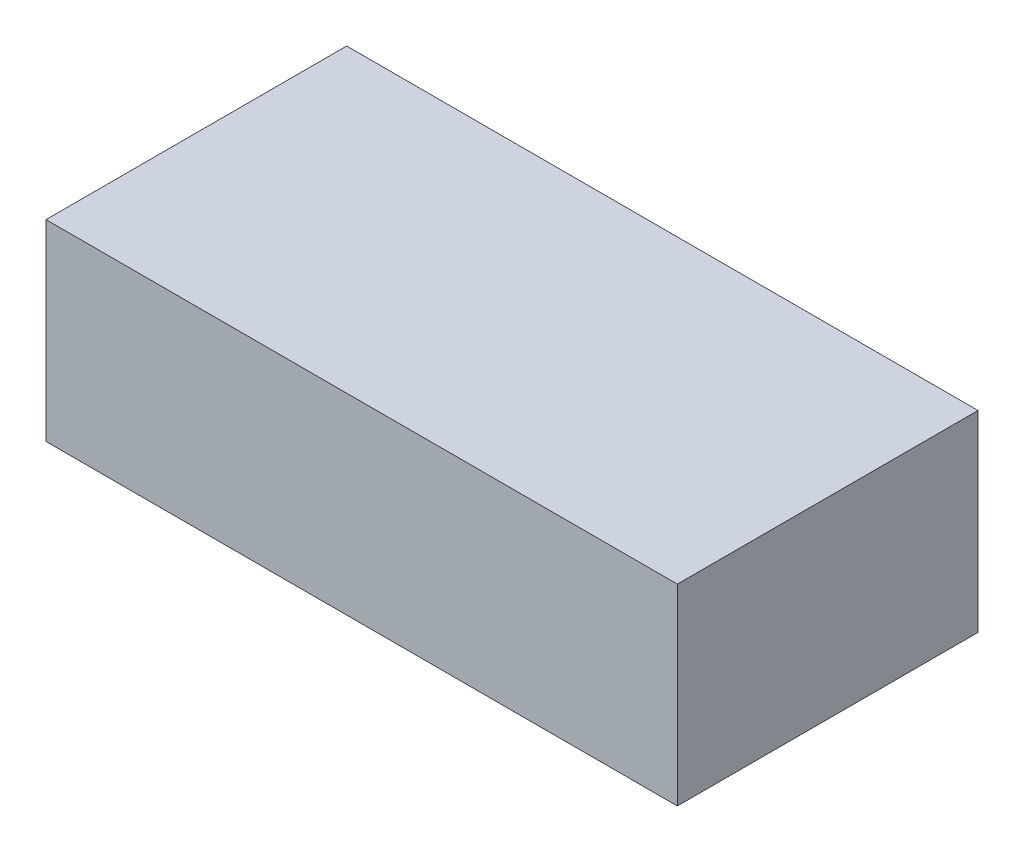
ISO-10303-21;
HEADER;
FILE_DESCRIPTION(('STEP AP214'),'2;1');
FILE_NAME('part.step','',(''),(''),'','','');
FILE_SCHEMA(('AUTOMOTIVE_DESIGN { 1 0 10303 214 1 1 1 1 }'));
ENDSEC;
DATA;
#1=APPLICATION_CONTEXT('core data for automotive mechanical design processes');
#2=APPLICATION_PROTOCOL_DEFINITION('international standard','automotive_design',2000,#1);
#3=PRODUCT_CONTEXT('',#1,'mechanical');
#4=PRODUCT('Part','Part','',(#3));
#5=PRODUCT_RELATED_PRODUCT_CATEGORY('part','',(#4));
#6=PRODUCT_DEFINITION_FORMATION('','',#4);
#7=PRODUCT_DEFINITION_CONTEXT('part definition',#1,'design');
#8=PRODUCT_DEFINITION('design','',#6,#7);
#9=PRODUCT_DEFINITION_SHAPE('','',#8);
#10=(LENGTH_UNIT() NAMED_UNIT(*) SI_UNIT(.MILLI.,.METRE.));
#11=(NAMED_UNIT(*) PLANE_ANGLE_UNIT() SI_UNIT($,.RADIAN.));
#12=(NAMED_UNIT(*) SI_UNIT($,.STERADIAN.) SOLID_ANGLE_UNIT());
#13=UNCERTAINTY_MEASURE_WITH_UNIT(LENGTH_MEASURE(1.E-05),#10,'distance_accuracy_value','');
#14=(GEOMETRIC_REPRESENTATION_CONTEXT(3) GLOBAL_UNCERTAINTY_ASSIGNED_CONTEXT((#13)) GLOBAL_UNIT_ASSIGNED_CONTEXT((#10,
#11,#12)) REPRESENTATION_CONTEXT('',''));
#15=CARTESIAN_POINT('',(0.,0.,0.));
#16=DIRECTION('',(0.,0.,1.));
#17=DIRECTION('',(1.,0.,0.));
#18=AXIS2_PLACEMENT_3D('',#15,#16,#17);
#19=CARTESIAN_POINT('',(40.,24.35,19.05));
#20=DIRECTION('',(-1.,0.,0.));
#21=DIRECTION('',(0.,0.,1.));
#22=AXIS2_PLACEMENT_3D('',#19,#20,#21);
#23=PLANE('',#22);
#24=DIRECTION('',(0.,0.,-1.));
#25=VECTOR('',#24,1.);
#26=CARTESIAN_POINT('',(40.,0.,19.05));
#27=LINE('',#26,#25);
#28=CARTESIAN_POINT('',(40.,0.,19.05));
#29=VERTEX_POINT('',#28);
#30=CARTESIAN_POINT('',(40.,0.,-19.05));
#31=VERTEX_POINT('',#30);
#32=EDGE_CURVE('E98',#29,#31,#27,.T.);
#33=ORIENTED_EDGE('',*,*,#32,.T.);
#34=DIRECTION('',(0.,-1.,0.));
#35=VECTOR('',#34,1.);
#36=CARTESIAN_POINT('',(40.,24.35,-19.05));
#37=LINE('',#36,#35);
#38=CARTESIAN_POINT('',(40.,24.35,-19.05));
#39=VERTEX_POINT('',#38);
#40=EDGE_CURVE('E11',#39,#31,#37,.T.);
#41=ORIENTED_EDGE('',*,*,#40,.F.);
#42=DIRECTION('',(0.,0.,-1.));
#43=VECTOR('',#42,1.);
#44=CARTESIAN_POINT('',(40.,24.35,19.05));
#45=LINE('',#44,#43);
#46=CARTESIAN_POINT('',(40.,24.35,19.05));
#47=VERTEX_POINT('',#46);
#48=EDGE_CURVE('E86',#47,#39,#45,.T.);
#49=ORIENTED_EDGE('',*,*,#48,.F.);
#50=DIRECTION('',(0.,-1.,0.));
#51=VECTOR('',#50,1.);
#52=CARTESIAN_POINT('',(40.,24.35,19.05));
#53=LINE('',#52,#51);
#54=EDGE_CURVE('E94',#47,#29,#53,.T.);
#55=ORIENTED_EDGE('',*,*,#54,.T.);
#56=EDGE_LOOP('',(#33,#41,#49,#55));
#57=FACE_BOUND('',#56,.T.);
#58=ADVANCED_FACE('F35',(#57),#23,.F.);
#59=CARTESIAN_POINT('',(-40.,24.35,-19.05));
#60=DIRECTION('',(0.,0.,1.));
#61=DIRECTION('',(1.,0.,0.));
#62=AXIS2_PLACEMENT_3D('',#59,#60,#61);
#63=PLANE('',#62);
#64=DIRECTION('',(-1.,0.,0.));
#65=VECTOR('',#64,1.);
#66=CARTESIAN_POINT('',(-40.,0.,-19.05));
#67=LINE('',#66,#65);
#68=CARTESIAN_POINT('',(-40.,0.,-19.05));
#69=VERTEX_POINT('',#68);
#70=EDGE_CURVE('E90',#31,#69,#67,.T.);
#71=ORIENTED_EDGE('',*,*,#70,.T.);
#72=DIRECTION('',(0.,-1.,0.));
#73=VECTOR('',#72,1.);
#74=CARTESIAN_POINT('',(-40.,24.35,-19.05));
#75=LINE('',#74,#73);
#76=CARTESIAN_POINT('',(-40.,24.35,-19.05));
#77=VERTEX_POINT('',#76);
#78=EDGE_CURVE('E43',#77,#69,#75,.T.);
#79=ORIENTED_EDGE('',*,*,#78,.F.);
#80=DIRECTION('',(-1.,0.,0.));
#81=VECTOR('',#80,1.);
#82=CARTESIAN_POINT('',(-40.,24.35,-19.05));
#83=LINE('',#82,#81);
#84=EDGE_CURVE('E81',#39,#77,#83,.T.);
#85=ORIENTED_EDGE('',*,*,#84,.F.);
#86=ORIENTED_EDGE('',*,*,#40,.T.);
#87=EDGE_LOOP('',(#71,#79,#85,#86));
#88=FACE_BOUND('',#87,.T.);
#89=ADVANCED_FACE('F89',(#88),#63,.F.);
#90=CARTESIAN_POINT('',(-40.,24.35,19.05));
#91=DIRECTION('',(1.,0.,0.));
#92=DIRECTION('',(0.,0.,-1.));
#93=AXIS2_PLACEMENT_3D('',#90,#91,#92);
#94=PLANE('',#93);
#95=DIRECTION('',(0.,0.,1.));
#96=VECTOR('',#95,1.);
#97=CARTESIAN_POINT('',(-40.,0.,19.05));
#98=LINE('',#97,#96);
#99=CARTESIAN_POINT('',(-40.,0.,19.05));
#100=VERTEX_POINT('',#99);
#101=EDGE_CURVE('E68',#69,#100,#98,.T.);
#102=ORIENTED_EDGE('',*,*,#101,.T.);
#103=DIRECTION('',(0.,-1.,0.));
#104=VECTOR('',#103,1.);
#105=CARTESIAN_POINT('',(-40.,24.35,19.05));
#106=LINE('',#105,#104);
#107=CARTESIAN_POINT('',(-40.,24.35,19.05));
#108=VERTEX_POINT('',#107);
#109=EDGE_CURVE('E91',#108,#100,#106,.T.);
#110=ORIENTED_EDGE('',*,*,#109,.F.);
#111=DIRECTION('',(0.,0.,1.));
#112=VECTOR('',#111,1.);
#113=CARTESIAN_POINT('',(-40.,24.35,19.05));
#114=LINE('',#113,#112);
#115=EDGE_CURVE('E84',#77,#108,#114,.T.);
#116=ORIENTED_EDGE('',*,*,#115,.F.);
#117=ORIENTED_EDGE('',*,*,#78,.T.);
#118=EDGE_LOOP('',(#102,#110,#116,#117));
#119=FACE_BOUND('',#118,.T.);
#120=ADVANCED_FACE('F92',(#119),#94,.F.);
#121=CARTESIAN_POINT('',(-40.,24.35,19.05));
#122=DIRECTION('',(0.,0.,-1.));
#123=DIRECTION('',(-1.,0.,0.));
#124=AXIS2_PLACEMENT_3D('',#121,#122,#123);
#125=PLANE('',#124);
#126=DIRECTION('',(1.,0.,0.));
#127=VECTOR('',#126,1.);
#128=CARTESIAN_POINT('',(-40.,0.,19.05));
#129=LINE('',#128,#127);
#130=EDGE_CURVE('E74',#100,#29,#129,.T.);
#131=ORIENTED_EDGE('',*,*,#130,.T.);
#132=ORIENTED_EDGE('',*,*,#54,.F.);
#133=DIRECTION('',(1.,0.,0.));
#134=VECTOR('',#133,1.);
#135=CARTESIAN_POINT('',(-40.,24.35,19.05));
#136=LINE('',#135,#134);
#137=EDGE_CURVE('E51',#108,#47,#136,.T.);
#138=ORIENTED_EDGE('',*,*,#137,.F.);
#139=ORIENTED_EDGE('',*,*,#109,.T.);
#140=EDGE_LOOP('',(#131,#132,#138,#139));
#141=FACE_BOUND('',#140,.T.);
#142=ADVANCED_FACE('F105',(#141),#125,.F.);
#143=CARTESIAN_POINT('',(0.,24.35,0.));
#144=DIRECTION('',(0.,-1.,0.));
#145=DIRECTION('',(0.,0.,-1.));
#146=AXIS2_PLACEMENT_3D('',#143,#144,#145);
#147=PLANE('',#146);
#148=ORIENTED_EDGE('',*,*,#48,.T.);
#149=ORIENTED_EDGE('',*,*,#84,.T.);
#150=ORIENTED_EDGE('',*,*,#115,.T.);
#151=ORIENTED_EDGE('',*,*,#137,.T.);
#152=EDGE_LOOP('',(#148,#149,#150,#151));
#153=FACE_BOUND('',#152,.T.);
#154=ADVANCED_FACE('F82',(#153),#147,.F.);
#155=CARTESIAN_POINT('',(0.,0.,0.));
#156=DIRECTION('',(0.,-1.,0.));
#157=DIRECTION('',(0.,0.,-1.));
#158=AXIS2_PLACEMENT_3D('',#155,#156,#157);
#159=PLANE('',#158);
#160=ORIENTED_EDGE('',*,*,#32,.F.);
#161=ORIENTED_EDGE('',*,*,#130,.F.);
#162=ORIENTED_EDGE('',*,*,#101,.F.);
#163=ORIENTED_EDGE('',*,*,#70,.F.);
#164=EDGE_LOOP('',(#160,#161,#162,#163));
#165=FACE_BOUND('',#164,.T.);
#166=ADVANCED_FACE('F108',(#165),#159,.T.);
#167=CLOSED_SHELL('',(#58,#89,#120,#142,#154,#166));
#168=MANIFOLD_SOLID_BREP('B2',#167);
#169=ADVANCED_BREP_SHAPE_REPRESENTATION('',(#18,#168),#14);
#170=SHAPE_DEFINITION_REPRESENTATION(#9,#169);
ENDSEC;
END-ISO-10303-21;
